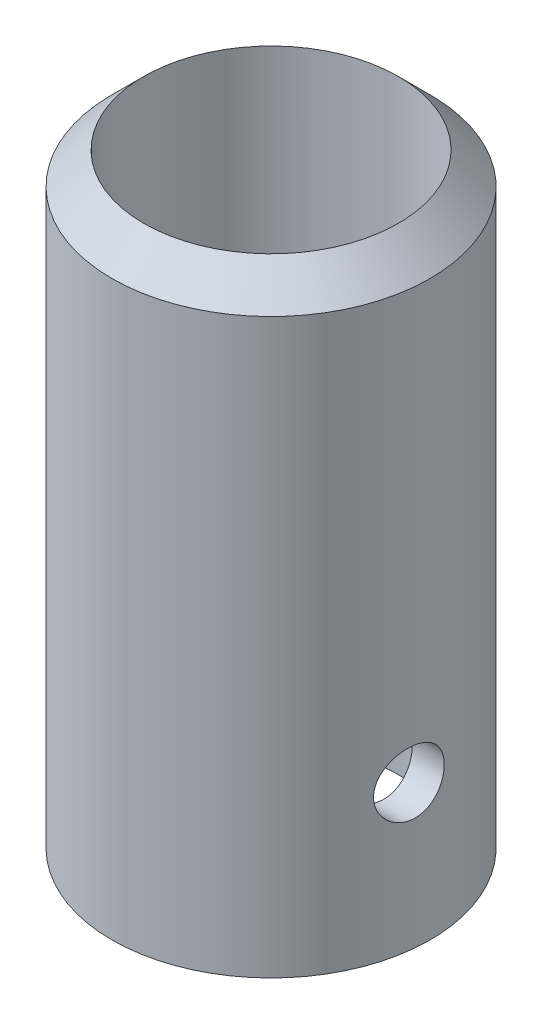
ISO-10303-21;
HEADER;
FILE_DESCRIPTION(('STEP AP214'),'2;1');
FILE_NAME('part.step','',(''),(''),'','','');
FILE_SCHEMA(('AUTOMOTIVE_DESIGN { 1 0 10303 214 1 1 1 1 }'));
ENDSEC;
DATA;
#1=APPLICATION_CONTEXT('core data for automotive mechanical design processes');
#2=APPLICATION_PROTOCOL_DEFINITION('international standard','automotive_design',2000,#1);
#3=PRODUCT_CONTEXT('',#1,'mechanical');
#4=PRODUCT('Part','Part','',(#3));
#5=PRODUCT_RELATED_PRODUCT_CATEGORY('part','',(#4));
#6=PRODUCT_DEFINITION_FORMATION('','',#4);
#7=PRODUCT_DEFINITION_CONTEXT('part definition',#1,'design');
#8=PRODUCT_DEFINITION('design','',#6,#7);
#9=PRODUCT_DEFINITION_SHAPE('','',#8);
#10=(LENGTH_UNIT() NAMED_UNIT(*) SI_UNIT(.MILLI.,.METRE.));
#11=(NAMED_UNIT(*) PLANE_ANGLE_UNIT() SI_UNIT($,.RADIAN.));
#12=(NAMED_UNIT(*) SI_UNIT($,.STERADIAN.) SOLID_ANGLE_UNIT());
#13=UNCERTAINTY_MEASURE_WITH_UNIT(LENGTH_MEASURE(1.E-05),#10,'distance_accuracy_value','');
#14=(GEOMETRIC_REPRESENTATION_CONTEXT(3) GLOBAL_UNCERTAINTY_ASSIGNED_CONTEXT((#13)) GLOBAL_UNIT_ASSIGNED_CONTEXT((#10,
#11,#12)) REPRESENTATION_CONTEXT('',''));
#15=CARTESIAN_POINT('',(0.,0.,0.));
#16=DIRECTION('',(0.,0.,1.));
#17=DIRECTION('',(1.,0.,0.));
#18=AXIS2_PLACEMENT_3D('',#15,#16,#17);
#19=CARTESIAN_POINT('',(72.5816548165307,100.,-46.8464860914251));
#20=DIRECTION('',(0.,-1.,0.));
#21=DIRECTION('',(0.,0.,-1.));
#22=AXIS2_PLACEMENT_3D('',#19,#20,#21);
#23=CYLINDRICAL_SURFACE('',#22,25.);
#24=CARTESIAN_POINT('',(72.5816548165307,89.9999999999999,-46.8464860914251));
#25=DIRECTION('',(0.,1.,0.));
#26=DIRECTION('',(0.,0.,1.));
#27=AXIS2_PLACEMENT_3D('',#24,#25,#26);
#28=CIRCLE('',#27,25.);
#29=CARTESIAN_POINT('',(72.5816548165307,89.9999999999999,-21.8464860914251));
#30=VERTEX_POINT('',#29);
#31=EDGE_CURVE('E10',#30,#30,#28,.F.);
#32=ORIENTED_EDGE('',*,*,#31,.T.);
#33=EDGE_LOOP('',(#32));
#34=FACE_BOUND('',#33,.T.);
#35=CARTESIAN_POINT('',(72.5816548165307,0.,-46.8464860914251));
#36=DIRECTION('',(0.,1.,0.));
#37=DIRECTION('',(0.,0.,1.));
#38=AXIS2_PLACEMENT_3D('',#35,#36,#37);
#39=CIRCLE('',#38,25.);
#40=CARTESIAN_POINT('',(72.5816548165307,0.,-21.8464860914251));
#41=VERTEX_POINT('',#40);
#42=EDGE_CURVE('E58',#41,#41,#39,.T.);
#43=ORIENTED_EDGE('',*,*,#42,.T.);
#44=EDGE_LOOP('',(#43));
#45=FACE_BOUND('',#44,.T.);
#46=CARTESIAN_POINT('',(97.5816548165307,18.4334858115339,-46.8464860914251));
#47=CARTESIAN_POINT('',(97.581655569114,18.5088068381918,-46.9648146653743));
#48=CARTESIAN_POINT('',(97.5808138779864,18.5890948699204,-47.0799425716855));
#49=CARTESIAN_POINT('',(97.5777339838054,18.7590787383433,-47.3030690663424));
#50=CARTESIAN_POINT('',(97.5754954884131,18.84877654115,-47.4110661570374));
#51=CARTESIAN_POINT('',(97.5699278705075,19.0369712431137,-47.6191821782389));
#52=CARTESIAN_POINT('',(97.5665980853471,19.1354734619454,-47.7192962761528));
#53=CARTESIAN_POINT('',(97.559168707442,19.3405697533291,-47.9109096473702));
#54=CARTESIAN_POINT('',(97.5550688327414,19.4471667811244,-48.0024057468487));
#55=CARTESIAN_POINT('',(97.5464280099525,19.6675605197345,-48.1760157347342));
#56=CARTESIAN_POINT('',(97.541887491201,19.7813501855193,-48.2581385893722));
#57=CARTESIAN_POINT('',(97.5326748633885,20.0154666193151,-48.4125595331897));
#58=CARTESIAN_POINT('',(97.5280027065182,20.1357957775131,-48.484853995821));
#59=CARTESIAN_POINT('',(97.518827486529,20.3820414089329,-48.6190383785895));
#60=CARTESIAN_POINT('',(97.5143243310754,20.5079547466827,-48.6809340463737));
#61=CARTESIAN_POINT('',(97.5057512543302,20.7645961428568,-48.7939541557942));
#62=CARTESIAN_POINT('',(97.5016814931946,20.8953259573006,-48.8450746223648));
#63=CARTESIAN_POINT('',(97.4941999760007,21.1609805463881,-48.9362693905676));
#64=CARTESIAN_POINT('',(97.4907899482059,21.2959152920866,-48.9763147941797));
#65=CARTESIAN_POINT('',(97.4848299527047,21.5687483547139,-49.0449071253588));
#66=CARTESIAN_POINT('',(97.4822803039219,21.7066477504698,-49.0734497898748));
#67=CARTESIAN_POINT('',(97.4781830143299,21.9843263670197,-49.1187984294557));
#68=CARTESIAN_POINT('',(97.4766350040897,22.124104875308,-49.1356087319094));
#69=CARTESIAN_POINT('',(97.474622384925,22.4046385771598,-49.1573915217521));
#70=CARTESIAN_POINT('',(97.4741581746431,22.5453941110057,-49.1623596533755));
#71=CARTESIAN_POINT('',(97.4743399419406,22.8262366686699,-49.1604081620647));
#72=CARTESIAN_POINT('',(97.4749812384325,22.9663240049195,-49.1535386636839));
#73=CARTESIAN_POINT('',(97.477327205582,23.2454336213299,-49.1280713763843));
#74=CARTESIAN_POINT('',(97.479032267849,23.3844554901672,-49.1094692682545));
#75=CARTESIAN_POINT('',(97.4856239163661,23.7983256597033,-49.0362201499946));
#76=CARTESIAN_POINT('',(97.4919874421584,24.0702799468386,-48.9641279676767));
#77=CARTESIAN_POINT('',(97.5072968072417,24.5980529463469,-48.7755260728264));
#78=CARTESIAN_POINT('',(97.5162424694895,24.8538727635098,-48.6590194053831));
#79=CARTESIAN_POINT('',(97.5346554136379,25.3424526924812,-48.3848539488879));
#80=CARTESIAN_POINT('',(97.5441227146033,25.5752119606094,-48.2271936549792));
#81=CARTESIAN_POINT('',(97.5611379576424,26.011974700406,-47.8744142707516));
#82=CARTESIAN_POINT('',(97.5686781763659,26.2158610445086,-47.6791497839708));
#83=CARTESIAN_POINT('',(97.5791725291682,26.5879830180302,-47.2570656695954));
#84=CARTESIAN_POINT('',(97.5821268401478,26.7562200224005,-47.0302472595559));
#85=CARTESIAN_POINT('',(97.5810617489957,27.0514786281463,-46.5526955598744));
#86=CARTESIAN_POINT('',(97.5770752819604,27.1786915030222,-46.3020805204683));
#87=CARTESIAN_POINT('',(97.5603861673799,27.3893299996224,-45.7833624133241));
#88=CARTESIAN_POINT('',(97.54768434549,27.4727597678493,-45.5152610043467));
#89=CARTESIAN_POINT('',(97.5127856642572,27.5929361537491,-44.9724973351618));
#90=CARTESIAN_POINT('',(97.4906942800698,27.6301838636428,-44.6979390387912));
#91=CARTESIAN_POINT('',(97.4370622100494,27.6589813466114,-44.1473709227941));
#92=CARTESIAN_POINT('',(97.4055214310385,27.6505306690527,-43.8713610888807));
#93=CARTESIAN_POINT('',(97.3338782759157,27.5885684975695,-43.3245891480279));
#94=CARTESIAN_POINT('',(97.2937454920461,27.5348949224282,-43.053849505459));
#95=CARTESIAN_POINT('',(97.2069137001508,27.384261329123,-42.5258040897442));
#96=CARTESIAN_POINT('',(97.1602137482681,27.287295084416,-42.2685002549435));
#97=CARTESIAN_POINT('',(97.0617014138291,27.0500835089742,-41.7676989687485));
#98=CARTESIAN_POINT('',(97.0097914041894,26.9088305195762,-41.5246980149582));
#99=CARTESIAN_POINT('',(96.9052844519815,26.5877735013428,-41.0657838992674));
#100=CARTESIAN_POINT('',(96.8526873905698,26.4079627177361,-40.849875494111));
#101=CARTESIAN_POINT('',(96.7495664572514,26.0103582036815,-40.4467785660932));
#102=CARTESIAN_POINT('',(96.6991051888912,25.7918759949405,-40.2602517067412));
#103=CARTESIAN_POINT('',(96.6055388217044,25.3251492078415,-39.9267246090109));
#104=CARTESIAN_POINT('',(96.5624330494676,25.0769073575835,-39.7797207515143));
#105=CARTESIAN_POINT('',(96.4880927130652,24.5618570297637,-39.5322037203449));
#106=CARTESIAN_POINT('',(96.4566681843814,24.2954375152271,-39.4309402505136));
#107=CARTESIAN_POINT('',(96.4076699006511,23.7481046280108,-39.2749746976116));
#108=CARTESIAN_POINT('',(96.3900914508144,23.4671962025382,-39.2202568318186));
#109=CARTESIAN_POINT('',(96.3709757202844,22.9120258259367,-39.1608415222798));
#110=CARTESIAN_POINT('',(96.3687728806272,22.6380075676601,-39.1540685147674));
#111=CARTESIAN_POINT('',(96.3788522424229,22.0928297806711,-39.1853073678605));
#112=CARTESIAN_POINT('',(96.3911328825669,21.8216699470017,-39.2233144012092));
#113=CARTESIAN_POINT('',(96.4286716371435,21.2949464910253,-39.3415878770481));
#114=CARTESIAN_POINT('',(96.4536892323012,21.0391887252624,-39.4210717590235));
#115=CARTESIAN_POINT('',(96.5144097759376,20.5446791444953,-39.6191835132203));
#116=CARTESIAN_POINT('',(96.5501142269826,20.3059297267036,-39.7378168900809));
#117=CARTESIAN_POINT('',(96.6305044478874,19.8446306166082,-40.0146371178005));
#118=CARTESIAN_POINT('',(96.6754206441571,19.6227514855054,-40.173871227968));
#119=CARTESIAN_POINT('',(96.770110492054,19.2082725073594,-40.52575316986));
#120=CARTESIAN_POINT('',(96.8198852698946,19.0156794753874,-40.7184087567242));
#121=CARTESIAN_POINT('',(96.8965374621033,18.748675503316,-41.0328098032922));
#122=CARTESIAN_POINT('',(96.9229681069627,18.6618286483792,-41.1443445739033));
#123=CARTESIAN_POINT('',(96.9757081735474,18.4978775781038,-41.3743697921531));
#124=CARTESIAN_POINT('',(97.0020176332617,18.4207700763919,-41.4928578736474));
#125=CARTESIAN_POINT('',(97.0540716480013,18.2767878647562,-41.7360759735084));
#126=CARTESIAN_POINT('',(97.0798159559797,18.2099175564516,-41.8608086464051));
#127=CARTESIAN_POINT('',(97.1302941293789,18.0869428697748,-42.1156124302945));
#128=CARTESIAN_POINT('',(97.1550283769045,18.0308343899542,-42.2456814845017));
#129=CARTESIAN_POINT('',(97.2033503337797,17.9292732465712,-42.5116776667204));
#130=CARTESIAN_POINT('',(97.2269239165003,17.8839340983128,-42.6476507389237));
#131=CARTESIAN_POINT('',(97.2722885622962,17.8050516993032,-42.9232102404964));
#132=CARTESIAN_POINT('',(97.2940803150171,17.7715038680566,-43.0627952440889));
#133=CARTESIAN_POINT('',(97.3355990521084,17.7164852806514,-43.344693747027));
#134=CARTESIAN_POINT('',(97.3553251407646,17.6950197461178,-43.4870083986165));
#135=CARTESIAN_POINT('',(97.3924534311962,17.6644320175774,-43.7732007657072));
#136=CARTESIAN_POINT('',(97.4098565941383,17.6553047039752,-43.9170778079169));
#137=CARTESIAN_POINT('',(97.4418067557062,17.6495875169884,-44.2020702109114));
#138=CARTESIAN_POINT('',(97.4564098722445,17.6527162747602,-44.3431736634487));
#139=CARTESIAN_POINT('',(97.4831418540365,17.6709185614125,-44.6247881406307));
#140=CARTESIAN_POINT('',(97.4952716951386,17.6859873677501,-44.7652993774245));
#141=CARTESIAN_POINT('',(97.5170309307256,17.727994852001,-45.0446459403142));
#142=CARTESIAN_POINT('',(97.5266618998246,17.7549260260747,-45.1834822689658));
#143=CARTESIAN_POINT('',(97.54347383564,17.8204804156863,-45.4584723167595));
#144=CARTESIAN_POINT('',(97.5506552716742,17.8591013888402,-45.5946265450624));
#145=CARTESIAN_POINT('',(97.5654380416058,17.9681955905344,-45.9250589211429));
#146=CARTESIAN_POINT('',(97.5717157632452,18.0451503322535,-46.1172944975063));
#147=CARTESIAN_POINT('',(97.5798235755852,18.2223041882186,-46.4908316603711));
#148=CARTESIAN_POINT('',(97.5816537076271,18.3225030863965,-46.6721333484898));
#149=CARTESIAN_POINT('',(97.5816548165307,18.4334858115339,-46.8464860914251));
#150=B_SPLINE_CURVE_WITH_KNOTS('',3,(#46,#47,#48,#49,#50,#51,#52,#53,#54,#55,#56,#57,#58,#59,
#60,#61,#62,#63,#64,#65,#66,#67,#68,#69,#70,#71,#72,#73,#74,#75,#76,#77,#78,#79,#80,#81,#82,#83,
#84,#85,#86,#87,#88,#89,#90,#91,#92,#93,#94,#95,#96,#97,#98,#99,#100,#101,#102,#103,#104,#105,
#106,#107,#108,#109,#110,#111,#112,#113,#114,#115,#116,#117,#118,#119,#120,#121,#122,#123,#124,
#125,#126,#127,#128,#129,#130,#131,#132,#133,#134,#135,#136,#137,#138,#139,#140,#141,#142,#143,
#144,#145,#146,#147,#148,#149),.UNSPECIFIED.,.T.,.F.,(4,2,2,2,2,2,2,2,2,2,2,2,2,2,2,2,2,2,2,2,2,
2,2,2,2,2,2,2,2,2,2,2,2,2,2,2,2,2,2,2,2,2,2,2,2,2,2,2,2,2,2,4),(0.,0.420619518707071,
0.841327098927804,1.26229061373467,1.6834085591692,2.10412023553257,2.52498673008765,
2.94561983148253,3.36640783754906,3.78828365818556,4.21031568751409,4.63219197128225,
5.05422340488117,5.47447220191691,5.894875798579,6.73479011096077,7.57464684856403,
8.41453430135432,9.25773685374707,10.1009068789317,10.9400868246604,11.7791872810521,
12.6091011745047,13.4390232517861,14.2719325284362,15.1049616363916,15.9585194606048,
16.812226938217,17.6830291875078,18.5537516703222,19.409620685159,20.2651993754016,
21.08349960669,21.9017116338603,22.7050162700899,23.5084339036295,24.3351501378716,
25.1620584610691,25.5930702185364,26.0239361479187,26.4549868167298,26.8858728796578,
27.3211170292499,27.7561919150557,28.1914546837725,28.6265367899816,29.0516896933416,
29.47667452358,29.9013909041744,30.3260258655514,30.9457988084066,31.5655659903403),.UNSPECIFIED.);
#151=CARTESIAN_POINT('',(97.5816548165307,18.4334858115339,-46.8464860914251));
#152=VERTEX_POINT('',#151);
#153=EDGE_CURVE('E84',#152,#152,#150,.T.);
#154=ORIENTED_EDGE('',*,*,#153,.F.);
#155=EDGE_LOOP('',(#154));
#156=FACE_BOUND('',#155,.T.);
#157=CARTESIAN_POINT('',(48.792139815928,22.6514073356157,-39.1615022894837));
#158=CARTESIAN_POINT('',(48.792141755635,22.7877827412783,-39.1614992578135));
#159=CARTESIAN_POINT('',(48.7903348597032,22.9241232786343,-39.167083762755));
#160=CARTESIAN_POINT('',(48.7831544588994,23.1958397740556,-39.1893633102776));
#161=CARTESIAN_POINT('',(48.7777803431879,23.3312155629067,-39.2060602557195));
#162=CARTESIAN_POINT('',(48.7635857301026,23.6000412603025,-39.2504263879672));
#163=CARTESIAN_POINT('',(48.7547634058946,23.733490109044,-39.2781013909793));
#164=CARTESIAN_POINT('',(48.733874340652,23.9974943524858,-39.3441820048256));
#165=CARTESIAN_POINT('',(48.7218063800547,24.1280486395401,-39.3825916494633));
#166=CARTESIAN_POINT('',(48.69472687658,24.3850441848087,-39.4697152626266));
#167=CARTESIAN_POINT('',(48.6797217758663,24.5114937508809,-39.5184066977192));
#168=CARTESIAN_POINT('',(48.6470786819328,24.7597621498752,-39.6257376999198));
#169=CARTESIAN_POINT('',(48.629439715437,24.8815792500251,-39.6843809455559));
#170=CARTESIAN_POINT('',(48.5731243359828,25.2388014357992,-39.8745444828591));
#171=CARTESIAN_POINT('',(48.5310202766372,25.466243924332,-40.0203895160736));
#172=CARTESIAN_POINT('',(48.4397437144808,25.8998639758935,-40.3504746714595));
#173=CARTESIAN_POINT('',(48.390407363211,26.1052754188438,-40.5356687283282));
#174=CARTESIAN_POINT('',(48.2892589905121,26.4826342032764,-40.9369788125777));
#175=CARTESIAN_POINT('',(48.2374464745142,26.6545748244875,-41.1531010346321));
#176=CARTESIAN_POINT('',(48.1331483910081,26.965974126732,-41.6187428157654));
#177=CARTESIAN_POINT('',(48.0807008864259,27.1041134478932,-41.869154870955));
#178=CARTESIAN_POINT('',(47.9805177799202,27.3360094012422,-42.390649089866));
#179=CARTESIAN_POINT('',(47.9327821403149,27.4297663883884,-42.6617310882545));
#180=CARTESIAN_POINT('',(47.8450894029018,27.569464040751,-43.2159671721138));
#181=CARTESIAN_POINT('',(47.8051008836028,27.6156012911222,-43.4990665621264));
#182=CARTESIAN_POINT('',(47.7346298440768,27.6587628829237,-44.0701472450012));
#183=CARTESIAN_POINT('',(47.7041456061465,27.6557961041448,-44.3581276457902));
#184=CARTESIAN_POINT('',(47.6542389202496,27.6010716070363,-44.9224197355727));
#185=CARTESIAN_POINT('',(47.6345385913268,27.5506408743707,-45.1988359431407));
#186=CARTESIAN_POINT('',(47.6046928682747,27.4040399609424,-45.7397908473431));
#187=CARTESIAN_POINT('',(47.594546740976,27.3078732907121,-46.004330453879));
#188=CARTESIAN_POINT('',(47.5826552747174,27.0741650365611,-46.5100597140391));
#189=CARTESIAN_POINT('',(47.580792648297,26.9372305965217,-46.7515276774679));
#190=CARTESIAN_POINT('',(47.5832301583171,26.6253666091738,-47.2084967244066));
#191=CARTESIAN_POINT('',(47.5875305519102,26.4504354767078,-47.4239967239937));
#192=CARTESIAN_POINT('',(47.5999820361755,26.0660683418726,-47.8245181528121));
#193=CARTESIAN_POINT('',(47.6081606406776,25.8563928737304,-48.0093088607269));
#194=CARTESIAN_POINT('',(47.6258362031223,25.4092634071446,-48.3414301395495));
#195=CARTESIAN_POINT('',(47.6353332268813,25.171808021999,-48.4887588392844));
#196=CARTESIAN_POINT('',(47.653368285689,24.67335784458,-48.7430645236176));
#197=CARTESIAN_POINT('',(47.6618966142178,24.4121652373214,-48.8496547651215));
#198=CARTESIAN_POINT('',(47.6759545657414,23.875519468905,-49.0174868033436));
#199=CARTESIAN_POINT('',(47.6814842457779,23.6000665791217,-49.0787294626912));
#200=CARTESIAN_POINT('',(47.6883493348435,23.0431199722082,-49.1540381498849));
#201=CARTESIAN_POINT('',(47.6896905527167,22.7616351669157,-49.1681695167137));
#202=CARTESIAN_POINT('',(47.6879124729324,22.2003002449559,-49.1490234400336));
#203=CARTESIAN_POINT('',(47.6847932265409,21.9204501095376,-49.1157465414085));
#204=CARTESIAN_POINT('',(47.6747696797633,21.3711671430211,-49.0029247112819));
#205=CARTESIAN_POINT('',(47.6678764275945,21.1017063505072,-48.9235147906802));
#206=CARTESIAN_POINT('',(47.6518090010672,20.5799021941902,-48.7208022596929));
#207=CARTESIAN_POINT('',(47.6426347389913,20.3275594891473,-48.5974979612469));
#208=CARTESIAN_POINT('',(47.6241096195942,19.8461666441821,-48.309937395445));
#209=CARTESIAN_POINT('',(47.6147582460167,19.6172034942985,-48.1455355121412));
#210=CARTESIAN_POINT('',(47.5984464407419,19.1900427882429,-47.7805994292383));
#211=CARTESIAN_POINT('',(47.5914860179251,18.9918453463429,-47.5800650954398));
#212=CARTESIAN_POINT('',(47.5825489857895,18.6318428030298,-47.1484851949234));
#213=CARTESIAN_POINT('',(47.580572785311,18.4700406880034,-46.9174371268946));
#214=CARTESIAN_POINT('',(47.5839204667678,18.1875435963991,-46.4314993618198));
#215=CARTESIAN_POINT('',(47.5892436889948,18.0668449062005,-46.176611821281));
#216=CARTESIAN_POINT('',(47.6087906165565,17.8710282541143,-45.6532259237612));
#217=CARTESIAN_POINT('',(47.6229216919463,17.7954517495123,-45.3848956165555));
#218=CARTESIAN_POINT('',(47.6608025810705,17.6899046710028,-44.8400851705312));
#219=CARTESIAN_POINT('',(47.6845519525088,17.6599320003105,-44.5636054070062));
#220=CARTESIAN_POINT('',(47.7413362438106,17.6460698323486,-44.0118565879255));
#221=CARTESIAN_POINT('',(47.7743247758413,17.6619537155044,-43.7365882886254));
#222=CARTESIAN_POINT('',(47.8484688559007,17.7383539486724,-43.1934500389505));
#223=CARTESIAN_POINT('',(47.8896251583157,17.7988744227849,-42.9255807745661));
#224=CARTESIAN_POINT('',(47.9788254927866,17.9638059490447,-42.3997811719428));
#225=CARTESIAN_POINT('',(48.0269758306699,18.0689541107095,-42.1421010736366));
#226=CARTESIAN_POINT('',(48.1267943178151,18.3201847000695,-41.6480917255782));
#227=CARTESIAN_POINT('',(48.1784630469033,18.4662738872119,-41.411766010006));
#228=CARTESIAN_POINT('',(48.2566844568587,18.7151704631998,-41.0750315823138));
#229=CARTESIAN_POINT('',(48.2832346630425,18.8044877536169,-40.9644048032703));
#230=CARTESIAN_POINT('',(48.3358649577822,18.9922643943415,-40.7511021088201));
#231=CARTESIAN_POINT('',(48.3619452109788,19.0907204656232,-40.6484233656963));
#232=CARTESIAN_POINT('',(48.4131517825773,19.2962144612877,-40.4516588558449));
#233=CARTESIAN_POINT('',(48.4382774960481,19.4032576983018,-40.3575784868793));
#234=CARTESIAN_POINT('',(48.4870429372167,19.625149149864,-40.1787832676241));
#235=CARTESIAN_POINT('',(48.5106832525564,19.7399942400013,-40.0940647034965));
#236=CARTESIAN_POINT('',(48.5560218802939,19.9769542787816,-39.9344779055538));
#237=CARTESIAN_POINT('',(48.5777172822074,20.099079681992,-39.8596243581681));
#238=CARTESIAN_POINT('',(48.6186360892536,20.3495726382985,-39.7205484213299));
#239=CARTESIAN_POINT('',(48.637860495011,20.4779376354781,-39.6563217255106));
#240=CARTESIAN_POINT('',(48.6733854118684,20.7399554784265,-39.5390645500723));
#241=CARTESIAN_POINT('',(48.6896882768366,20.8736039603766,-39.4860250508402));
#242=CARTESIAN_POINT('',(48.7189897114257,21.1452506287899,-39.3915782039109));
#243=CARTESIAN_POINT('',(48.7319890642588,21.2832477755144,-39.3501680988172));
#244=CARTESIAN_POINT('',(48.7591953314487,21.6230361302077,-39.264051932141));
#245=CARTESIAN_POINT('',(48.7714954434378,21.8266190864343,-39.2256581658241));
#246=CARTESIAN_POINT('',(48.7879659079924,22.2372974322283,-39.1743866042424));
#247=CARTESIAN_POINT('',(48.7921368714968,22.4443925566617,-39.1615068914904));
#248=CARTESIAN_POINT('',(48.792139815928,22.6514073356157,-39.1615022894837));
#249=B_SPLINE_CURVE_WITH_KNOTS('',3,(#157,#158,#159,#160,#161,#162,#163,#164,#165,#166,#167,
#168,#169,#170,#171,#172,#173,#174,#175,#176,#177,#178,#179,#180,#181,#182,#183,#184,#185,#186,
#187,#188,#189,#190,#191,#192,#193,#194,#195,#196,#197,#198,#199,#200,#201,#202,#203,#204,#205,
#206,#207,#208,#209,#210,#211,#212,#213,#214,#215,#216,#217,#218,#219,#220,#221,#222,#223,#224,
#225,#226,#227,#228,#229,#230,#231,#232,#233,#234,#235,#236,#237,#238,#239,#240,#241,#242,#243,
#244,#245,#246,#247,#248),.UNSPECIFIED.,.T.,.F.,(4,2,2,2,2,2,2,2,2,2,2,2,2,2,2,2,2,2,2,2,2,2,2,
2,2,2,2,2,2,2,2,2,2,2,2,2,2,2,2,2,2,2,2,2,2,4),(0.,0.408940136669539,0.817950317043024,
1.2271774822201,1.63655863173329,2.04505172977168,2.45369615097171,3.27014590082629,
4.10927317162931,4.94856874901688,5.81670793461827,6.68484017695094,7.54937406020124,
8.4137516060516,9.25465909828467,10.0955020557799,10.92440067651,11.7533338841287,
12.5882379801511,13.4231837702319,14.265869940201,15.1085400796684,15.950041026719,
16.7915323021083,17.6305732235722,18.4696464157914,19.311735808228,20.1538283283284,
20.9959899204104,21.8380754045057,22.6714509384181,23.5047881540193,24.3340141413055,
25.1633167527118,26.0068852723187,26.8505931489499,27.2840934887314,27.7174388839684,
28.1510544762529,28.5844974305235,29.0185785491442,29.4524833300033,29.8860369289668,
30.3194876429032,30.9402961721648,31.5610580433154),.UNSPECIFIED.);
#250=CARTESIAN_POINT('',(48.792139815928,22.6514073356157,-39.1615022894837));
#251=VERTEX_POINT('',#250);
#252=EDGE_CURVE('E79',#251,#251,#249,.T.);
#253=ORIENTED_EDGE('',*,*,#252,.F.);
#254=EDGE_LOOP('',(#253));
#255=FACE_BOUND('',#254,.T.);
#256=ADVANCED_FACE('F39',(#34,#45,#156,#255),#23,.T.);
#257=CARTESIAN_POINT('',(72.5816548165307,0.,-46.8464860914251));
#258=DIRECTION('',(0.,1.,0.));
#259=DIRECTION('',(0.,0.,1.));
#260=AXIS2_PLACEMENT_3D('',#257,#258,#259);
#261=CYLINDRICAL_SURFACE('',#260,20.);
#262=CARTESIAN_POINT('',(72.5816548165307,94.9999999999999,-46.8464860914251));
#263=DIRECTION('',(0.,-1.,0.));
#264=DIRECTION('',(0.,0.,-1.));
#265=AXIS2_PLACEMENT_3D('',#262,#263,#264);
#266=CIRCLE('',#265,20.);
#267=CARTESIAN_POINT('',(72.5816548165307,94.9999999999999,-66.8464860914251));
#268=VERTEX_POINT('',#267);
#269=EDGE_CURVE('E53',#268,#268,#266,.F.);
#270=ORIENTED_EDGE('',*,*,#269,.T.);
#271=EDGE_LOOP('',(#270));
#272=FACE_BOUND('',#271,.T.);
#273=CARTESIAN_POINT('',(72.5816548165307,0.,-46.8464860914251));
#274=DIRECTION('',(0.,1.,0.));
#275=DIRECTION('',(0.,0.,1.));
#276=AXIS2_PLACEMENT_3D('',#273,#274,#275);
#277=CIRCLE('',#276,20.);
#278=CARTESIAN_POINT('',(72.5816548165307,0.,-26.8464860914251));
#279=VERTEX_POINT('',#278);
#280=EDGE_CURVE('E104',#279,#279,#277,.T.);
#281=ORIENTED_EDGE('',*,*,#280,.F.);
#282=EDGE_LOOP('',(#281));
#283=FACE_BOUND('',#282,.T.);
#284=CARTESIAN_POINT('',(54.1170664386681,22.6514073356157,-39.1615022894837));
#285=CARTESIAN_POINT('',(54.1170702345157,22.5173936896027,-39.1614974863449));
#286=CARTESIAN_POINT('',(54.1148210586332,22.3834260422123,-39.1668917296519));
#287=CARTESIAN_POINT('',(54.1058907080515,22.1164647418716,-39.1883993087105));
#288=CARTESIAN_POINT('',(54.0992090240446,21.9834712026248,-39.2045138762581));
#289=CARTESIAN_POINT('',(54.0815745606354,21.7194420857277,-39.247304574796));
#290=CARTESIAN_POINT('',(54.0706202616782,21.5884072219148,-39.2739844633923));
#291=CARTESIAN_POINT('',(54.0447070281177,21.32921876435,-39.3376414832375));
#292=CARTESIAN_POINT('',(54.0297465577897,21.2010662959994,-39.3746225635614));
#293=CARTESIAN_POINT('',(53.9962231395761,20.9489213476426,-39.4584040428425));
#294=CARTESIAN_POINT('',(53.9776709410895,20.824917718392,-39.5051751750202));
#295=CARTESIAN_POINT('',(53.9373514274967,20.581431383943,-39.6081846720054));
#296=CARTESIAN_POINT('',(53.9155829166888,20.4619503809244,-39.6644265587675));
#297=CARTESIAN_POINT('',(53.846141913544,20.1114441241445,-39.8466665726226));
#298=CARTESIAN_POINT('',(53.7943026214412,19.8881291165646,-39.98625495724));
#299=CARTESIAN_POINT('',(53.6811343174176,19.4581609169359,-40.304318321656));
#300=CARTESIAN_POINT('',(53.6194905679979,19.2526552816421,-40.4842208803799));
#301=CARTESIAN_POINT('',(53.4930023187782,18.87395879656,-40.8744355563976));
#302=CARTESIAN_POINT('',(53.4281568901374,18.7007773948576,-41.0847565329413));
#303=CARTESIAN_POINT('',(53.2959757298925,18.3819948776139,-41.5434143782269));
#304=CARTESIAN_POINT('',(53.2287027928734,18.2384704656211,-41.7932172042909));
#305=CARTESIAN_POINT('',(53.0999261570679,17.9959625322392,-42.314997483322));
#306=CARTESIAN_POINT('',(53.0384224797223,17.8969791763772,-42.5869750186922));
#307=CARTESIAN_POINT('',(52.9252324706972,17.7475000435361,-43.1443971004791));
#308=CARTESIAN_POINT('',(52.8734972535257,17.6967574010275,-43.429765153731));
#309=CARTESIAN_POINT('',(52.7821136469718,17.6454171804078,-44.0068709676052));
#310=CARTESIAN_POINT('',(52.7424616643363,17.6448046803153,-44.2986068068975));
#311=CARTESIAN_POINT('',(52.6778982953888,17.6935546836542,-44.8668828934937));
#312=CARTESIAN_POINT('',(52.6524331130253,17.7407989991703,-45.1435428961644));
#313=CARTESIAN_POINT('',(52.6135111478669,17.8812022280774,-45.6858238015512));
#314=CARTESIAN_POINT('',(52.6000528682111,17.9743554159132,-45.9514460763667));
#315=CARTESIAN_POINT('',(52.5838677728546,18.2013365651176,-46.4575923298284));
#316=CARTESIAN_POINT('',(52.5808990709214,18.3341700203622,-46.6985558226284));
#317=CARTESIAN_POINT('',(52.5827346902637,18.6374933591064,-47.1554448831313));
#318=CARTESIAN_POINT('',(52.5875394500601,18.8079853665528,-47.3713690375647));
#319=CARTESIAN_POINT('',(52.6021599558081,19.1838450463117,-47.774356203691));
#320=CARTESIAN_POINT('',(52.6120268009778,19.389553823642,-47.9610990667177));
#321=CARTESIAN_POINT('',(52.6336787030129,19.8289535244273,-48.2979753455695));
#322=CARTESIAN_POINT('',(52.6454639165231,20.0626467325432,-48.4481057692971));
#323=CARTESIAN_POINT('',(52.6681847404275,20.5553311651953,-48.7096212714284));
#324=CARTESIAN_POINT('',(52.6791051098736,20.8146469197326,-48.8203969583269));
#325=CARTESIAN_POINT('',(52.6973965293183,21.3483037135031,-48.9968824124893));
#326=CARTESIAN_POINT('',(52.704767674324,21.6226443503256,-49.0625933860822));
#327=CARTESIAN_POINT('',(52.7143541080501,22.1781398771378,-49.1469629041687));
#328=CARTESIAN_POINT('',(52.7165771499647,22.4592838749193,-49.1656922079777));
#329=CARTESIAN_POINT('',(52.7154182053827,23.0207144579304,-49.155742545278));
#330=CARTESIAN_POINT('',(52.7120363406466,23.3010010616533,-49.1270646086386));
#331=CARTESIAN_POINT('',(52.7004166090178,23.8513243898127,-49.0234173539297));
#332=CARTESIAN_POINT('',(52.6922028454585,24.1214049578313,-48.9486777214059));
#333=CARTESIAN_POINT('',(52.6727129613065,24.6452346400695,-48.7552605466126));
#334=CARTESIAN_POINT('',(52.6614366633895,24.898982807571,-48.6365804599945));
#335=CARTESIAN_POINT('',(52.6383515831397,25.3844223702468,-48.3578553968325));
#336=CARTESIAN_POINT('',(52.6265402875113,25.6159892642344,-48.1975937544922));
#337=CARTESIAN_POINT('',(52.6055705259701,26.0490710693135,-47.8404500422795));
#338=CARTESIAN_POINT('',(52.5964120943126,26.2505855923354,-47.6435674995912));
#339=CARTESIAN_POINT('',(52.5839852987272,26.6180049701915,-47.2184763980475));
#340=CARTESIAN_POINT('',(52.580722359059,26.7838769079108,-46.9902391982405));
#341=CARTESIAN_POINT('',(52.5830555332669,27.0749107620115,-46.5091855773617));
#342=CARTESIAN_POINT('',(52.5886504305942,27.2000782659567,-46.2563725360494));
#343=CARTESIAN_POINT('',(52.6107491331358,27.4044847652006,-45.7378030128886));
#344=CARTESIAN_POINT('',(52.6270823534337,27.4844061601194,-45.4723081790211));
#345=CARTESIAN_POINT('',(52.6715866025991,27.5992613082366,-44.9327431243993));
#346=CARTESIAN_POINT('',(52.6997567292956,27.6341984891629,-44.6586735586566));
#347=CARTESIAN_POINT('',(52.7675141671577,27.6585705248732,-44.1124580806447));
#348=CARTESIAN_POINT('',(52.8069973107565,27.6484088001774,-43.8403168372491));
#349=CARTESIAN_POINT('',(52.8961927438258,27.5845700557606,-43.30292536147));
#350=CARTESIAN_POINT('',(52.945906250496,27.5308878557751,-43.0376759533044));
#351=CARTESIAN_POINT('',(53.0545765705235,27.3803809245853,-42.5144708041189));
#352=CARTESIAN_POINT('',(53.113728616069,27.2825396761226,-42.2568488529119));
#353=CARTESIAN_POINT('',(53.2370582007788,27.0465979332156,-41.7620304685469));
#354=CARTESIAN_POINT('',(53.3012370363539,26.9084870280436,-41.5248393378412));
#355=CARTESIAN_POINT('',(53.4334126662331,26.5889789192285,-41.0668627888905));
#356=CARTESIAN_POINT('',(53.5014560836139,26.405997002401,-40.847196686351));
#357=CARTESIAN_POINT('',(53.6337944843771,26.0044284233192,-40.441472863634));
#358=CARTESIAN_POINT('',(53.6980883591956,25.7858313030606,-40.255425049035));
#359=CARTESIAN_POINT('',(53.7879183074673,25.4345666055596,-40.0051814952195));
#360=CARTESIAN_POINT('',(53.816873542423,25.3129903354122,-39.9262862601318));
#361=CARTESIAN_POINT('',(53.871810576867,25.0629621048382,-39.7791041941287));
#362=CARTESIAN_POINT('',(53.8977936390615,24.9345130985423,-39.7108128537841));
#363=CARTESIAN_POINT('',(53.9461281319858,24.671690520149,-39.5855177210463));
#364=CARTESIAN_POINT('',(53.9684823812264,24.5373216501694,-39.5285051607881));
#365=CARTESIAN_POINT('',(54.0089924349183,24.2636014000589,-39.4262958676332));
#366=CARTESIAN_POINT('',(54.0271491897698,24.1242511560815,-39.3810964596894));
#367=CARTESIAN_POINT('',(54.0670673634864,23.7672407317098,-39.2824750563803));
#368=CARTESIAN_POINT('',(54.0857095091479,23.5469082228813,-39.2372127307542));
#369=CARTESIAN_POINT('',(54.1107047047417,23.1014757757955,-39.1767332049566));
#370=CARTESIAN_POINT('',(54.1170600665589,22.8763767424686,-39.1615103525378));
#371=CARTESIAN_POINT('',(54.1170664386681,22.6514073356157,-39.1615022894837));
#372=B_SPLINE_CURVE_WITH_KNOTS('',3,(#284,#285,#286,#287,#288,#289,#290,#291,#292,#293,#294,
#295,#296,#297,#298,#299,#300,#301,#302,#303,#304,#305,#306,#307,#308,#309,#310,#311,#312,#313,
#314,#315,#316,#317,#318,#319,#320,#321,#322,#323,#324,#325,#326,#327,#328,#329,#330,#331,#332,
#333,#334,#335,#336,#337,#338,#339,#340,#341,#342,#343,#344,#345,#346,#347,#348,#349,#350,#351,
#352,#353,#354,#355,#356,#357,#358,#359,#360,#361,#362,#363,#364,#365,#366,#367,#368,#369,#370,
#371),.UNSPECIFIED.,.T.,.F.,(4,2,2,2,2,2,2,2,2,2,2,2,2,2,2,2,2,2,2,2,2,2,2,2,2,2,2,2,2,2,2,2,2,
2,2,2,2,2,2,2,2,2,2,4),(0.,0.401834724938257,0.803715629815786,1.20573959408039,
1.60791789126115,2.00891064548715,2.41005285029291,3.21162297074854,4.04806583235389,
4.8847527972116,5.76810011891307,6.65145072335355,7.53025617021395,8.40880002662681,
9.25008748370267,10.0912700456025,10.9129238509309,11.7346240094714,12.5647869766406,
13.3950177649336,14.2375950812059,15.0801498418012,15.921434862704,16.7627016078715,
17.5998069631499,18.4369607981544,19.2785675298873,20.1201851284418,20.9625766797228,
21.8048525456894,22.6340615326442,23.4632073314114,24.2849512450344,25.1067929856218,
25.9486024909302,26.7906298186008,27.668296839154,28.546222042792,28.989139499228,
29.4318680809527,29.8742511314077,30.3165339188032,30.9912229303973,31.6657849799483),.UNSPECIFIED.);
#373=CARTESIAN_POINT('',(54.1170664386681,22.6514073356157,-39.1615022894837));
#374=VERTEX_POINT('',#373);
#375=EDGE_CURVE('E61',#374,#374,#372,.T.);
#376=ORIENTED_EDGE('',*,*,#375,.F.);
#377=EDGE_LOOP('',(#376));
#378=FACE_BOUND('',#377,.T.);
#379=CARTESIAN_POINT('',(91.0462431943933,22.6514073356157,-39.1615022894837));
#380=CARTESIAN_POINT('',(91.0462393985457,22.7854209816286,-39.1614974863449));
#381=CARTESIAN_POINT('',(91.0484885744281,22.919388629019,-39.1668917296519));
#382=CARTESIAN_POINT('',(91.0574189250098,23.1863499293597,-39.1883993087105));
#383=CARTESIAN_POINT('',(91.0641006090167,23.3193434686066,-39.2045138762581));
#384=CARTESIAN_POINT('',(91.0817350724259,23.5833725855036,-39.2473045747959));
#385=CARTESIAN_POINT('',(91.0926893713831,23.7144074493165,-39.2739844633923));
#386=CARTESIAN_POINT('',(91.1186026049436,23.9735959068813,-39.3376414832375));
#387=CARTESIAN_POINT('',(91.1335630752716,24.1017483752319,-39.3746225635614));
#388=CARTESIAN_POINT('',(91.1670864934852,24.3538933235887,-39.4584040428425));
#389=CARTESIAN_POINT('',(91.1856386919718,24.4778969528393,-39.5051751750202));
#390=CARTESIAN_POINT('',(91.2259582055646,24.7213832872883,-39.6081846720054));
#391=CARTESIAN_POINT('',(91.2477267163725,24.8408642903069,-39.6644265587675));
#392=CARTESIAN_POINT('',(91.3171677195173,25.1913705470868,-39.8466665726226));
#393=CARTESIAN_POINT('',(91.3690070116201,25.4146855546667,-39.98625495724));
#394=CARTESIAN_POINT('',(91.4821753156437,25.8446537542954,-40.304318321656));
#395=CARTESIAN_POINT('',(91.5438190650634,26.0501593895892,-40.4842208803799));
#396=CARTESIAN_POINT('',(91.6703073142831,26.4288558746713,-40.8744355563976));
#397=CARTESIAN_POINT('',(91.7351527429239,26.6020372763737,-41.0847565329413));
#398=CARTESIAN_POINT('',(91.8673339031688,26.9208197936174,-41.5434143782269));
#399=CARTESIAN_POINT('',(91.9346068401879,27.0643442056102,-41.7932172042909));
#400=CARTESIAN_POINT('',(92.0633834759934,27.3068521389921,-42.314997483322));
#401=CARTESIAN_POINT('',(92.124887153339,27.4058354948542,-42.5869750186922));
#402=CARTESIAN_POINT('',(92.2380771623641,27.5553146276952,-43.144397100479));
#403=CARTESIAN_POINT('',(92.2898123795356,27.6060572702039,-43.429765153731));
#404=CARTESIAN_POINT('',(92.3811959860896,27.6573974908235,-44.0068709676052));
#405=CARTESIAN_POINT('',(92.420847968725,27.6580099909161,-44.2986068068975));
#406=CARTESIAN_POINT('',(92.4854113376725,27.6092599875771,-44.8668828934937));
#407=CARTESIAN_POINT('',(92.510876520036,27.562015672061,-45.1435428961644));
#408=CARTESIAN_POINT('',(92.5497984851945,27.4216124431539,-45.6858238015512));
#409=CARTESIAN_POINT('',(92.5632567648502,27.3284592553181,-45.9514460763667));
#410=CARTESIAN_POINT('',(92.5794418602067,27.1014781061137,-46.4575923298284));
#411=CARTESIAN_POINT('',(92.5824105621399,26.9686446508691,-46.6985558226284));
#412=CARTESIAN_POINT('',(92.5805749427976,26.665321312125,-47.1554448831313));
#413=CARTESIAN_POINT('',(92.5757701830013,26.4948293046785,-47.3713690375647));
#414=CARTESIAN_POINT('',(92.5611496772532,26.1189696249197,-47.774356203691));
#415=CARTESIAN_POINT('',(92.5512828320835,25.9132608475893,-47.9610990667177));
#416=CARTESIAN_POINT('',(92.5296309300484,25.473861146804,-48.2979753455695));
#417=CARTESIAN_POINT('',(92.5178457165382,25.2401679386882,-48.4481057692971));
#418=CARTESIAN_POINT('',(92.4951248926338,24.747483506036,-48.7096212714284));
#419=CARTESIAN_POINT('',(92.4842045231878,24.4881677514987,-48.8203969583269));
#420=CARTESIAN_POINT('',(92.465913103743,23.9545109577282,-48.9968824124893));
#421=CARTESIAN_POINT('',(92.4585419587373,23.6801703209058,-49.0625933860822));
#422=CARTESIAN_POINT('',(92.4489555250112,23.1246747940935,-49.1469629041687));
#423=CARTESIAN_POINT('',(92.4467324830966,22.843530796312,-49.1656922079777));
#424=CARTESIAN_POINT('',(92.4478914276786,22.282100213301,-49.155742545278));
#425=CARTESIAN_POINT('',(92.4512732924147,22.001813609578,-49.1270646086386));
#426=CARTESIAN_POINT('',(92.4628930240435,21.4514902814186,-49.0234173539297));
#427=CARTESIAN_POINT('',(92.4711067876028,21.1814097134,-48.9486777214059));
#428=CARTESIAN_POINT('',(92.4905966717548,20.6575800311618,-48.7552605466126));
#429=CARTESIAN_POINT('',(92.5018729696718,20.4038318636603,-48.6365804599944));
#430=CARTESIAN_POINT('',(92.5249580499217,19.9183923009845,-48.3578553968325));
#431=CARTESIAN_POINT('',(92.53676934555,19.6868254069969,-48.1975937544922));
#432=CARTESIAN_POINT('',(92.5577391070912,19.2537436019178,-47.8404500422795));
#433=CARTESIAN_POINT('',(92.5668975387487,19.052229078896,-47.6435674995912));
#434=CARTESIAN_POINT('',(92.5793243343341,18.6848097010398,-47.2184763980475));
#435=CARTESIAN_POINT('',(92.5825872740023,18.5189377633205,-46.9902391982405));
#436=CARTESIAN_POINT('',(92.5802540997944,18.2279039092198,-46.5091855773617));
#437=CARTESIAN_POINT('',(92.5746592024671,18.1027364052746,-46.2563725360494));
#438=CARTESIAN_POINT('',(92.5525604999255,17.8983299060307,-45.7378030128886));
#439=CARTESIAN_POINT('',(92.5362272796276,17.8184085111119,-45.4723081790211));
#440=CARTESIAN_POINT('',(92.4917230304623,17.7035533629947,-44.9327431243992));
#441=CARTESIAN_POINT('',(92.4635529037657,17.6686161820685,-44.6586735586566));
#442=CARTESIAN_POINT('',(92.3957954659036,17.6442441463581,-44.1124580806447));
#443=CARTESIAN_POINT('',(92.3563123223048,17.6544058710539,-43.8403168372491));
#444=CARTESIAN_POINT('',(92.2671168892356,17.7182446154707,-43.30292536147));
#445=CARTESIAN_POINT('',(92.2174033825654,17.7719268154563,-43.0376759533044));
#446=CARTESIAN_POINT('',(92.1087330625378,17.922433746646,-42.5144708041189));
#447=CARTESIAN_POINT('',(92.0495810169923,18.0202749951087,-42.2568488529119));
#448=CARTESIAN_POINT('',(91.9262514322825,18.2562167380158,-41.7620304685469));
#449=CARTESIAN_POINT('',(91.8620725967074,18.3943276431877,-41.5248393378412));
#450=CARTESIAN_POINT('',(91.7298969668282,18.7138357520028,-41.0668627888905));
#451=CARTESIAN_POINT('',(91.6618535494474,18.8968176688304,-40.8471966863509));
#452=CARTESIAN_POINT('',(91.5295151486842,19.2983862479121,-40.441472863634));
#453=CARTESIAN_POINT('',(91.4652212738657,19.5169833681707,-40.255425049035));
#454=CARTESIAN_POINT('',(91.3753913255941,19.8682480656717,-40.0051814952195));
#455=CARTESIAN_POINT('',(91.3464360906383,19.9898243358191,-39.9262862601318));
#456=CARTESIAN_POINT('',(91.2914990561943,20.2398525663931,-39.7791041941287));
#457=CARTESIAN_POINT('',(91.2655159939998,20.368301572689,-39.7108128537841));
#458=CARTESIAN_POINT('',(91.2171815010755,20.6311241510823,-39.5855177210463));
#459=CARTESIAN_POINT('',(91.194827251835,20.7654930210619,-39.5285051607881));
#460=CARTESIAN_POINT('',(91.1543171981431,21.0392132711724,-39.4262958676331));
#461=CARTESIAN_POINT('',(91.1361604432915,21.1785635151498,-39.3810964596894));
#462=CARTESIAN_POINT('',(91.0962422695749,21.5355739395215,-39.2824750563803));
#463=CARTESIAN_POINT('',(91.0776001239134,21.75590644835,-39.2372127307542));
#464=CARTESIAN_POINT('',(91.0526049283196,22.2013388954359,-39.1767332049566));
#465=CARTESIAN_POINT('',(91.0462495665024,22.4264379287627,-39.1615103525378));
#466=CARTESIAN_POINT('',(91.0462431943933,22.6514073356157,-39.1615022894837));
#467=B_SPLINE_CURVE_WITH_KNOTS('',3,(#379,#380,#381,#382,#383,#384,#385,#386,#387,#388,#389,
#390,#391,#392,#393,#394,#395,#396,#397,#398,#399,#400,#401,#402,#403,#404,#405,#406,#407,#408,
#409,#410,#411,#412,#413,#414,#415,#416,#417,#418,#419,#420,#421,#422,#423,#424,#425,#426,#427,
#428,#429,#430,#431,#432,#433,#434,#435,#436,#437,#438,#439,#440,#441,#442,#443,#444,#445,#446,
#447,#448,#449,#450,#451,#452,#453,#454,#455,#456,#457,#458,#459,#460,#461,#462,#463,#464,#465,
#466),.UNSPECIFIED.,.T.,.F.,(4,2,2,2,2,2,2,2,2,2,2,2,2,2,2,2,2,2,2,2,2,2,2,2,2,2,2,2,2,2,2,2,2,
2,2,2,2,2,2,2,2,2,2,4),(0.,0.401834724938256,0.803715629815782,1.20573959408037,
1.60791789126115,2.00891064548713,2.41005285029291,3.21162297074854,4.0480658323539,
4.8847527972116,5.76810011891307,6.65145072335355,7.53025617021395,8.40880002662682,
9.25008748370267,10.0912700456025,10.9129238509309,11.7346240094714,12.5647869766406,
13.3950177649336,14.2375950812059,15.0801498418012,15.921434862704,16.7627016078715,
17.5998069631499,18.4369607981544,19.2785675298873,20.1201851284418,20.9625766797228,
21.8048525456895,22.6340615326442,23.4632073314114,24.2849512450344,25.1067929856218,
25.9486024909302,26.7906298186008,27.668296839154,28.546222042792,28.989139499228,
29.4318680809527,29.8742511314077,30.3165339188032,30.9912229303973,31.6657849799483),.UNSPECIFIED.);
#468=CARTESIAN_POINT('',(91.0462431943933,22.6514073356157,-39.1615022894837));
#469=VERTEX_POINT('',#468);
#470=EDGE_CURVE('E44',#469,#469,#467,.T.);
#471=ORIENTED_EDGE('',*,*,#470,.F.);
#472=EDGE_LOOP('',(#471));
#473=FACE_BOUND('',#472,.T.);
#474=ADVANCED_FACE('F66',(#272,#283,#378,#473),#261,.F.);
#475=CARTESIAN_POINT('',(72.5816548165307,0.,-46.8464860914251));
#476=DIRECTION('',(0.,1.,0.));
#477=DIRECTION('',(0.,0.,1.));
#478=AXIS2_PLACEMENT_3D('',#475,#476,#477);
#479=PLANE('',#478);
#480=ORIENTED_EDGE('',*,*,#280,.T.);
#481=EDGE_LOOP('',(#480));
#482=FACE_BOUND('',#481,.T.);
#483=ORIENTED_EDGE('',*,*,#42,.F.);
#484=EDGE_LOOP('',(#483));
#485=FACE_BOUND('',#484,.T.);
#486=ADVANCED_FACE('F91',(#482,#485),#479,.F.);
#487=CARTESIAN_POINT('',(72.5816548165307,100.,-46.8464860914251));
#488=DIRECTION('',(0.,-1.,0.));
#489=DIRECTION('',(0.,0.,-1.));
#490=AXIS2_PLACEMENT_3D('',#487,#488,#489);
#491=CONICAL_SURFACE('',#490,14.9999999999998,0.785398163397454);
#492=ORIENTED_EDGE('',*,*,#31,.F.);
#493=EDGE_LOOP('',(#492));
#494=FACE_BOUND('',#493,.T.);
#495=ORIENTED_EDGE('',*,*,#269,.F.);
#496=EDGE_LOOP('',(#495));
#497=FACE_BOUND('',#496,.T.);
#498=ADVANCED_FACE('F42',(#494,#497),#491,.T.);
#499=CARTESIAN_POINT('',(97.5816548165307,22.6514073356157,-44.1615022894837));
#500=DIRECTION('',(-1.,0.,0.));
#501=DIRECTION('',(0.,0.,1.));
#502=AXIS2_PLACEMENT_3D('',#499,#500,#501);
#503=CYLINDRICAL_SURFACE('',#502,5.);
#504=ORIENTED_EDGE('',*,*,#375,.T.);
#505=EDGE_LOOP('',(#504));
#506=FACE_BOUND('',#505,.T.);
#507=ORIENTED_EDGE('',*,*,#252,.T.);
#508=EDGE_LOOP('',(#507));
#509=FACE_BOUND('',#508,.T.);
#510=ADVANCED_FACE('F72',(#506,#509),#503,.F.);
#511=ORIENTED_EDGE('',*,*,#470,.T.);
#512=EDGE_LOOP('',(#511));
#513=FACE_BOUND('',#512,.T.);
#514=ORIENTED_EDGE('',*,*,#153,.T.);
#515=EDGE_LOOP('',(#514));
#516=FACE_BOUND('',#515,.T.);
#517=ADVANCED_FACE('F69',(#513,#516),#503,.F.);
#518=CLOSED_SHELL('',(#256,#474,#486,#498,#510,#517));
#519=MANIFOLD_SOLID_BREP('B2',#518);
#520=ADVANCED_BREP_SHAPE_REPRESENTATION('',(#18,#519),#14);
#521=SHAPE_DEFINITION_REPRESENTATION(#9,#520);
ENDSEC;
END-ISO-10303-21;
